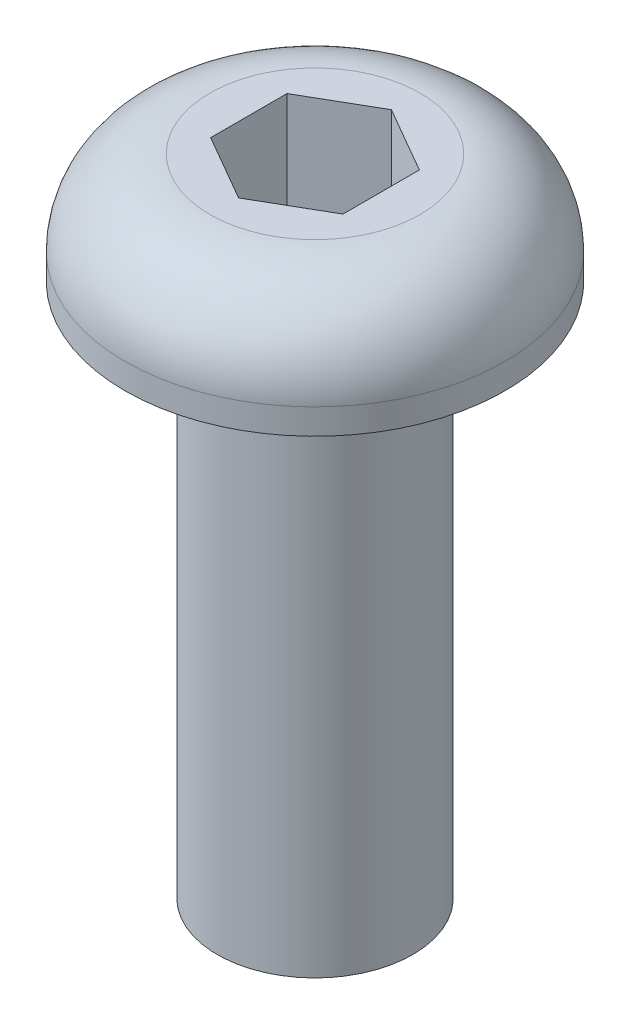
ISO-10303-21;
HEADER;
FILE_DESCRIPTION(('STEP AP214'),'2;1');
FILE_NAME('part.step','',(''),(''),'','','');
FILE_SCHEMA(('AUTOMOTIVE_DESIGN { 1 0 10303 214 1 1 1 1 }'));
ENDSEC;
DATA;
#1=APPLICATION_CONTEXT('core data for automotive mechanical design processes');
#2=APPLICATION_PROTOCOL_DEFINITION('international standard','automotive_design',2000,#1);
#3=PRODUCT_CONTEXT('',#1,'mechanical');
#4=PRODUCT('Part','Part','',(#3));
#5=PRODUCT_RELATED_PRODUCT_CATEGORY('part','',(#4));
#6=PRODUCT_DEFINITION_FORMATION('','',#4);
#7=PRODUCT_DEFINITION_CONTEXT('part definition',#1,'design');
#8=PRODUCT_DEFINITION('design','',#6,#7);
#9=PRODUCT_DEFINITION_SHAPE('','',#8);
#10=(LENGTH_UNIT() NAMED_UNIT(*) SI_UNIT(.MILLI.,.METRE.));
#11=(NAMED_UNIT(*) PLANE_ANGLE_UNIT() SI_UNIT($,.RADIAN.));
#12=(NAMED_UNIT(*) SI_UNIT($,.STERADIAN.) SOLID_ANGLE_UNIT());
#13=UNCERTAINTY_MEASURE_WITH_UNIT(LENGTH_MEASURE(1.E-05),#10,'distance_accuracy_value','');
#14=(GEOMETRIC_REPRESENTATION_CONTEXT(3) GLOBAL_UNCERTAINTY_ASSIGNED_CONTEXT((#13)) GLOBAL_UNIT_ASSIGNED_CONTEXT((#10,
#11,#12)) REPRESENTATION_CONTEXT('',''));
#15=CARTESIAN_POINT('',(0.,0.,0.));
#16=DIRECTION('',(0.,0.,1.));
#17=DIRECTION('',(1.,0.,0.));
#18=AXIS2_PLACEMENT_3D('',#15,#16,#17);
#19=CARTESIAN_POINT('',(0.,0.,0.));
#20=DIRECTION('',(0.,1.,0.));
#21=DIRECTION('',(0.,0.,1.));
#22=AXIS2_PLACEMENT_3D('',#19,#20,#21);
#23=PLANE('',#22);
#24=DIRECTION('',(0.,0.,1.));
#25=VECTOR('',#24,1.);
#26=CARTESIAN_POINT('',(-0.9906,0.,-0.571923176659243));
#27=LINE('',#26,#25);
#28=CARTESIAN_POINT('',(-0.990600000000001,0.,-0.571923176659244));
#29=VERTEX_POINT('',#28);
#30=CARTESIAN_POINT('',(-0.9906,0.,0.571923176659244));
#31=VERTEX_POINT('',#30);
#32=EDGE_CURVE('E82',#29,#31,#27,.T.);
#33=ORIENTED_EDGE('',*,*,#32,.T.);
#34=DIRECTION('',(0.866025403784439,0.,0.5));
#35=VECTOR('',#34,1.);
#36=CARTESIAN_POINT('',(-0.9906,0.,0.571923176659244));
#37=LINE('',#36,#35);
#38=CARTESIAN_POINT('',(0.,0.,1.14384635331849));
#39=VERTEX_POINT('',#38);
#40=EDGE_CURVE('E66',#31,#39,#37,.T.);
#41=ORIENTED_EDGE('',*,*,#40,.T.);
#42=DIRECTION('',(0.866025403784439,0.,-0.5));
#43=VECTOR('',#42,1.);
#44=CARTESIAN_POINT('',(0.,0.,1.14384635331849));
#45=LINE('',#44,#43);
#46=CARTESIAN_POINT('',(0.990600000000001,0.,0.571923176659244));
#47=VERTEX_POINT('',#46);
#48=EDGE_CURVE('E71',#39,#47,#45,.T.);
#49=ORIENTED_EDGE('',*,*,#48,.T.);
#50=DIRECTION('',(0.,0.,-1.));
#51=VECTOR('',#50,1.);
#52=CARTESIAN_POINT('',(0.9906,0.,0.571923176659243));
#53=LINE('',#52,#51);
#54=CARTESIAN_POINT('',(0.990599999999999,0.,-0.571923176659244));
#55=VERTEX_POINT('',#54);
#56=EDGE_CURVE('E131',#47,#55,#53,.T.);
#57=ORIENTED_EDGE('',*,*,#56,.T.);
#58=DIRECTION('',(-0.866025403784439,0.,-0.5));
#59=VECTOR('',#58,1.);
#60=CARTESIAN_POINT('',(0.990599999999999,0.,-0.571923176659244));
#61=LINE('',#60,#59);
#62=CARTESIAN_POINT('',(0.,0.,-1.14384635331849));
#63=VERTEX_POINT('',#62);
#64=EDGE_CURVE('E141',#55,#63,#61,.T.);
#65=ORIENTED_EDGE('',*,*,#64,.T.);
#66=DIRECTION('',(-0.866025403784439,0.,0.5));
#67=VECTOR('',#66,1.);
#68=CARTESIAN_POINT('',(0.,0.,-1.14384635331849));
#69=LINE('',#68,#67);
#70=EDGE_CURVE('E146',#63,#29,#69,.T.);
#71=ORIENTED_EDGE('',*,*,#70,.T.);
#72=EDGE_LOOP('',(#33,#41,#49,#57,#65,#71));
#73=FACE_BOUND('',#72,.T.);
#74=ADVANCED_FACE('F16',(#73),#23,.T.);
#75=CARTESIAN_POINT('',(0.,0.,1.14384635331849));
#76=DIRECTION('',(0.5,0.,0.866025403784439));
#77=DIRECTION('',(0.866025403784439,0.,-0.5));
#78=AXIS2_PLACEMENT_3D('',#75,#76,#77);
#79=PLANE('',#78);
#80=DIRECTION('',(0.,1.,0.));
#81=VECTOR('',#80,1.);
#82=CARTESIAN_POINT('',(0.,0.,1.14384635331849));
#83=LINE('',#82,#81);
#84=CARTESIAN_POINT('',(0.,1.651,1.14384635331849));
#85=VERTEX_POINT('',#84);
#86=EDGE_CURVE('E73',#39,#85,#83,.T.);
#87=ORIENTED_EDGE('',*,*,#86,.T.);
#88=DIRECTION('',(-0.866025403784437,0.,0.500000000000002));
#89=VECTOR('',#88,1.);
#90=CARTESIAN_POINT('',(0.9906,1.651,0.571923176659243));
#91=LINE('',#90,#89);
#92=CARTESIAN_POINT('',(0.990600000000001,1.651,0.571923176659245));
#93=VERTEX_POINT('',#92);
#94=EDGE_CURVE('E138',#93,#85,#91,.T.);
#95=ORIENTED_EDGE('',*,*,#94,.F.);
#96=DIRECTION('',(0.,1.,0.));
#97=VECTOR('',#96,1.);
#98=CARTESIAN_POINT('',(0.9906,0.,0.571923176659243));
#99=LINE('',#98,#97);
#100=EDGE_CURVE('E76',#93,#47,#99,.F.);
#101=ORIENTED_EDGE('',*,*,#100,.T.);
#102=ORIENTED_EDGE('',*,*,#48,.F.);
#103=EDGE_LOOP('',(#87,#95,#101,#102));
#104=FACE_BOUND('',#103,.T.);
#105=ADVANCED_FACE('F72',(#104),#79,.F.);
#106=CARTESIAN_POINT('',(-0.9906,0.,0.571923176659244));
#107=DIRECTION('',(-0.5,0.,0.866025403784439));
#108=DIRECTION('',(0.866025403784439,0.,0.5));
#109=AXIS2_PLACEMENT_3D('',#106,#107,#108);
#110=PLANE('',#109);
#111=DIRECTION('',(0.,1.,0.));
#112=VECTOR('',#111,1.);
#113=CARTESIAN_POINT('',(-0.9906,0.,0.571923176659244));
#114=LINE('',#113,#112);
#115=CARTESIAN_POINT('',(-0.9906,1.651,0.571923176659244));
#116=VERTEX_POINT('',#115);
#117=EDGE_CURVE('E84',#31,#116,#114,.T.);
#118=ORIENTED_EDGE('',*,*,#117,.T.);
#119=DIRECTION('',(-0.866025403784438,0.,-0.500000000000002));
#120=VECTOR('',#119,1.);
#121=CARTESIAN_POINT('',(0.,1.651,1.14384635331849));
#122=LINE('',#121,#120);
#123=EDGE_CURVE('E88',#85,#116,#122,.T.);
#124=ORIENTED_EDGE('',*,*,#123,.F.);
#125=ORIENTED_EDGE('',*,*,#86,.F.);
#126=ORIENTED_EDGE('',*,*,#40,.F.);
#127=EDGE_LOOP('',(#118,#124,#125,#126));
#128=FACE_BOUND('',#127,.T.);
#129=ADVANCED_FACE('F86',(#128),#110,.F.);
#130=CARTESIAN_POINT('',(-0.9906,0.,-0.571923176659243));
#131=DIRECTION('',(-1.,0.,0.));
#132=DIRECTION('',(0.,0.,1.));
#133=AXIS2_PLACEMENT_3D('',#130,#131,#132);
#134=PLANE('',#133);
#135=DIRECTION('',(0.,1.,0.));
#136=VECTOR('',#135,1.);
#137=CARTESIAN_POINT('',(-0.990600000000002,0.,-0.571923176659246));
#138=LINE('',#137,#136);
#139=CARTESIAN_POINT('',(-0.990600000000001,1.651,-0.571923176659244));
#140=VERTEX_POINT('',#139);
#141=EDGE_CURVE('E148',#29,#140,#138,.T.);
#142=ORIENTED_EDGE('',*,*,#141,.T.);
#143=DIRECTION('',(0.,0.,1.));
#144=VECTOR('',#143,1.);
#145=CARTESIAN_POINT('',(-0.9906,1.651,0.));
#146=LINE('',#145,#144);
#147=EDGE_CURVE('E153',#116,#140,#146,.F.);
#148=ORIENTED_EDGE('',*,*,#147,.F.);
#149=ORIENTED_EDGE('',*,*,#117,.F.);
#150=ORIENTED_EDGE('',*,*,#32,.F.);
#151=EDGE_LOOP('',(#142,#148,#149,#150));
#152=FACE_BOUND('',#151,.T.);
#153=ADVANCED_FACE('F154',(#152),#134,.F.);
#154=CARTESIAN_POINT('',(0.,0.,-1.14384635331849));
#155=DIRECTION('',(-0.5,0.,-0.866025403784439));
#156=DIRECTION('',(-0.866025403784439,0.,0.5));
#157=AXIS2_PLACEMENT_3D('',#154,#155,#156);
#158=PLANE('',#157);
#159=DIRECTION('',(0.,1.,0.));
#160=VECTOR('',#159,1.);
#161=CARTESIAN_POINT('',(0.,0.,-1.14384635331849));
#162=LINE('',#161,#160);
#163=CARTESIAN_POINT('',(0.,1.651,-1.14384635331849));
#164=VERTEX_POINT('',#163);
#165=EDGE_CURVE('E144',#63,#164,#162,.T.);
#166=ORIENTED_EDGE('',*,*,#165,.T.);
#167=DIRECTION('',(0.866025403784437,0.,-0.500000000000002));
#168=VECTOR('',#167,1.);
#169=CARTESIAN_POINT('',(-0.9906,1.651,-0.571923176659243));
#170=LINE('',#169,#168);
#171=EDGE_CURVE('E159',#140,#164,#170,.T.);
#172=ORIENTED_EDGE('',*,*,#171,.F.);
#173=ORIENTED_EDGE('',*,*,#141,.F.);
#174=ORIENTED_EDGE('',*,*,#70,.F.);
#175=EDGE_LOOP('',(#166,#172,#173,#174));
#176=FACE_BOUND('',#175,.T.);
#177=ADVANCED_FACE('F181',(#176),#158,.F.);
#178=CARTESIAN_POINT('',(0.990599999999999,0.,-0.571923176659244));
#179=DIRECTION('',(0.5,0.,-0.866025403784439));
#180=DIRECTION('',(-0.866025403784439,0.,-0.5));
#181=AXIS2_PLACEMENT_3D('',#178,#179,#180);
#182=PLANE('',#181);
#183=DIRECTION('',(0.,1.,0.));
#184=VECTOR('',#183,1.);
#185=CARTESIAN_POINT('',(0.9906,0.,-0.571923176659244));
#186=LINE('',#185,#184);
#187=CARTESIAN_POINT('',(0.990599999999999,1.651,-0.571923176659244));
#188=VERTEX_POINT('',#187);
#189=EDGE_CURVE('E34',#55,#188,#186,.T.);
#190=ORIENTED_EDGE('',*,*,#189,.T.);
#191=DIRECTION('',(0.866025403784437,0.,0.500000000000002));
#192=VECTOR('',#191,1.);
#193=CARTESIAN_POINT('',(0.,1.651,-1.14384635331849));
#194=LINE('',#193,#192);
#195=EDGE_CURVE('E167',#164,#188,#194,.T.);
#196=ORIENTED_EDGE('',*,*,#195,.F.);
#197=ORIENTED_EDGE('',*,*,#165,.F.);
#198=ORIENTED_EDGE('',*,*,#64,.F.);
#199=EDGE_LOOP('',(#190,#196,#197,#198));
#200=FACE_BOUND('',#199,.T.);
#201=ADVANCED_FACE('F179',(#200),#182,.F.);
#202=CARTESIAN_POINT('',(0.9906,0.,0.571923176659243));
#203=DIRECTION('',(1.,0.,0.));
#204=DIRECTION('',(0.,0.,-1.));
#205=AXIS2_PLACEMENT_3D('',#202,#203,#204);
#206=PLANE('',#205);
#207=ORIENTED_EDGE('',*,*,#100,.F.);
#208=DIRECTION('',(0.,0.,1.));
#209=VECTOR('',#208,1.);
#210=CARTESIAN_POINT('',(0.990599999999999,1.651,0.));
#211=LINE('',#210,#209);
#212=EDGE_CURVE('E105',#188,#93,#211,.T.);
#213=ORIENTED_EDGE('',*,*,#212,.F.);
#214=ORIENTED_EDGE('',*,*,#189,.F.);
#215=ORIENTED_EDGE('',*,*,#56,.F.);
#216=EDGE_LOOP('',(#207,#213,#214,#215));
#217=FACE_BOUND('',#216,.T.);
#218=ADVANCED_FACE('F177',(#217),#206,.F.);
#219=CARTESIAN_POINT('',(0.,1.651,0.));
#220=DIRECTION('',(0.,1.,0.));
#221=DIRECTION('',(0.,0.,1.));
#222=AXIS2_PLACEMENT_3D('',#219,#220,#221);
#223=PLANE('',#222);
#224=ORIENTED_EDGE('',*,*,#195,.T.);
#225=ORIENTED_EDGE('',*,*,#212,.T.);
#226=ORIENTED_EDGE('',*,*,#94,.T.);
#227=ORIENTED_EDGE('',*,*,#123,.T.);
#228=ORIENTED_EDGE('',*,*,#147,.T.);
#229=ORIENTED_EDGE('',*,*,#171,.T.);
#230=EDGE_LOOP('',(#224,#225,#226,#227,#228,#229));
#231=FACE_BOUND('',#230,.T.);
#232=CARTESIAN_POINT('',(0.,1.651,0.));
#233=DIRECTION('',(0.,-1.,0.));
#234=DIRECTION('',(1.,0.,0.));
#235=AXIS2_PLACEMENT_3D('',#232,#233,#234);
#236=CIRCLE('',#235,1.5748);
#237=CARTESIAN_POINT('',(1.5748,1.651,0.));
#238=VERTEX_POINT('',#237);
#239=EDGE_CURVE('E100',#238,#238,#236,.T.);
#240=ORIENTED_EDGE('',*,*,#239,.F.);
#241=EDGE_LOOP('',(#240));
#242=FACE_BOUND('',#241,.T.);
#243=ADVANCED_FACE('F120',(#231,#242),#223,.T.);
#244=CARTESIAN_POINT('',(0.,0.381,0.));
#245=DIRECTION('',(0.,1.,0.));
#246=DIRECTION('',(0.,0.,1.));
#247=AXIS2_PLACEMENT_3D('',#244,#245,#246);
#248=TOROIDAL_SURFACE('',#247,1.5748,1.27);
#249=ORIENTED_EDGE('',*,*,#239,.T.);
#250=EDGE_LOOP('',(#249));
#251=FACE_BOUND('',#250,.T.);
#252=CARTESIAN_POINT('',(0.,0.381,0.));
#253=DIRECTION('',(0.,1.,0.));
#254=DIRECTION('',(0.,0.,1.));
#255=AXIS2_PLACEMENT_3D('',#252,#253,#254);
#256=CIRCLE('',#255,2.8448);
#257=CARTESIAN_POINT('',(0.,0.381,2.8448));
#258=VERTEX_POINT('',#257);
#259=EDGE_CURVE('E96',#258,#258,#256,.F.);
#260=ORIENTED_EDGE('',*,*,#259,.F.);
#261=EDGE_LOOP('',(#260));
#262=FACE_BOUND('',#261,.T.);
#263=ADVANCED_FACE('F114',(#251,#262),#248,.T.);
#264=CARTESIAN_POINT('',(0.,0.,0.));
#265=DIRECTION('',(0.,1.,0.));
#266=DIRECTION('',(0.,0.,1.));
#267=AXIS2_PLACEMENT_3D('',#264,#265,#266);
#268=CYLINDRICAL_SURFACE('',#267,2.8448);
#269=ORIENTED_EDGE('',*,*,#259,.T.);
#270=EDGE_LOOP('',(#269));
#271=FACE_BOUND('',#270,.T.);
#272=CARTESIAN_POINT('',(0.,0.,0.));
#273=DIRECTION('',(0.,1.,0.));
#274=DIRECTION('',(0.,0.,1.));
#275=AXIS2_PLACEMENT_3D('',#272,#273,#274);
#276=CIRCLE('',#275,2.8448);
#277=CARTESIAN_POINT('',(0.,0.,2.8448));
#278=VERTEX_POINT('',#277);
#279=EDGE_CURVE('E19',#278,#278,#276,.T.);
#280=ORIENTED_EDGE('',*,*,#279,.T.);
#281=EDGE_LOOP('',(#280));
#282=FACE_BOUND('',#281,.T.);
#283=ADVANCED_FACE('F119',(#271,#282),#268,.T.);
#284=CARTESIAN_POINT('',(0.,-8.,0.));
#285=DIRECTION('',(0.,1.,0.));
#286=DIRECTION('',(0.,0.,1.));
#287=AXIS2_PLACEMENT_3D('',#284,#285,#286);
#288=PLANE('',#287);
#289=CARTESIAN_POINT('',(0.,-8.,0.));
#290=DIRECTION('',(0.,-1.,0.));
#291=DIRECTION('',(0.,0.,-1.));
#292=AXIS2_PLACEMENT_3D('',#289,#290,#291);
#293=CIRCLE('',#292,1.4635);
#294=CARTESIAN_POINT('',(0.,-8.,-1.4635));
#295=VERTEX_POINT('',#294);
#296=EDGE_CURVE('E25',#295,#295,#293,.F.);
#297=ORIENTED_EDGE('',*,*,#296,.F.);
#298=EDGE_LOOP('',(#297));
#299=FACE_BOUND('',#298,.T.);
#300=ADVANCED_FACE('F199',(#299),#288,.F.);
#301=CARTESIAN_POINT('',(0.,0.,0.));
#302=DIRECTION('',(0.,1.,0.));
#303=DIRECTION('',(0.,0.,1.));
#304=AXIS2_PLACEMENT_3D('',#301,#302,#303);
#305=PLANE('',#304);
#306=CARTESIAN_POINT('',(0.,0.,0.));
#307=DIRECTION('',(0.,-1.,0.));
#308=DIRECTION('',(0.,0.,-1.));
#309=AXIS2_PLACEMENT_3D('',#306,#307,#308);
#310=CIRCLE('',#309,1.4635);
#311=CARTESIAN_POINT('',(0.,0.,-1.4635));
#312=VERTEX_POINT('',#311);
#313=EDGE_CURVE('E11',#312,#312,#310,.T.);
#314=ORIENTED_EDGE('',*,*,#313,.F.);
#315=EDGE_LOOP('',(#314));
#316=FACE_BOUND('',#315,.T.);
#317=ORIENTED_EDGE('',*,*,#279,.F.);
#318=EDGE_LOOP('',(#317));
#319=FACE_BOUND('',#318,.T.);
#320=ADVANCED_FACE('F193',(#316,#319),#305,.F.);
#321=CARTESIAN_POINT('',(0.,0.,0.));
#322=DIRECTION('',(0.,-1.,0.));
#323=DIRECTION('',(0.,0.,-1.));
#324=AXIS2_PLACEMENT_3D('',#321,#322,#323);
#325=CYLINDRICAL_SURFACE('',#324,1.4635);
#326=ORIENTED_EDGE('',*,*,#313,.T.);
#327=EDGE_LOOP('',(#326));
#328=FACE_BOUND('',#327,.T.);
#329=ORIENTED_EDGE('',*,*,#296,.T.);
#330=EDGE_LOOP('',(#329));
#331=FACE_BOUND('',#330,.T.);
#332=ADVANCED_FACE('F191',(#328,#331),#325,.T.);
#333=CLOSED_SHELL('',(#74,#105,#129,#153,#177,#201,#218,#243,#263,#283,#300,#320,#332));
#334=MANIFOLD_SOLID_BREP('B1',#333);
#335=ADVANCED_BREP_SHAPE_REPRESENTATION('',(#18,#334),#14);
#336=SHAPE_DEFINITION_REPRESENTATION(#9,#335);
ENDSEC;
END-ISO-10303-21;
